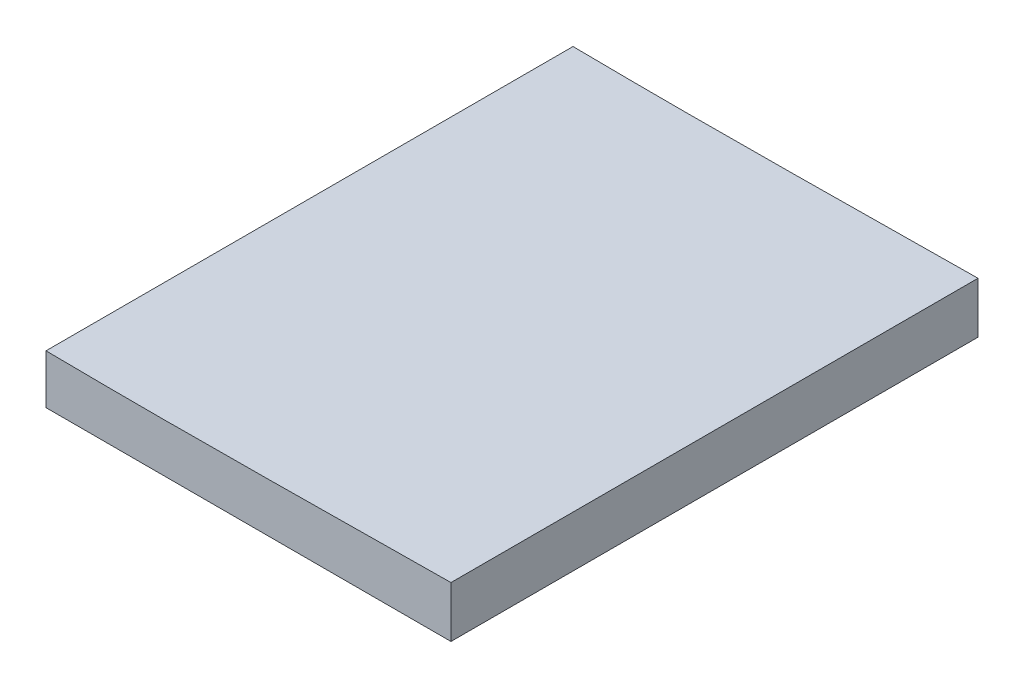
ISO-10303-21;
HEADER;
FILE_DESCRIPTION(('STEP AP214'),'2;1');
FILE_NAME('part.step','',(''),(''),'','','');
FILE_SCHEMA(('AUTOMOTIVE_DESIGN { 1 0 10303 214 1 1 1 1 }'));
ENDSEC;
DATA;
#1=APPLICATION_CONTEXT('core data for automotive mechanical design processes');
#2=APPLICATION_PROTOCOL_DEFINITION('international standard','automotive_design',2000,#1);
#3=PRODUCT_CONTEXT('',#1,'mechanical');
#4=PRODUCT('Part','Part','',(#3));
#5=PRODUCT_RELATED_PRODUCT_CATEGORY('part','',(#4));
#6=PRODUCT_DEFINITION_FORMATION('','',#4);
#7=PRODUCT_DEFINITION_CONTEXT('part definition',#1,'design');
#8=PRODUCT_DEFINITION('design','',#6,#7);
#9=PRODUCT_DEFINITION_SHAPE('','',#8);
#10=(LENGTH_UNIT() NAMED_UNIT(*) SI_UNIT(.MILLI.,.METRE.));
#11=(NAMED_UNIT(*) PLANE_ANGLE_UNIT() SI_UNIT($,.RADIAN.));
#12=(NAMED_UNIT(*) SI_UNIT($,.STERADIAN.) SOLID_ANGLE_UNIT());
#13=UNCERTAINTY_MEASURE_WITH_UNIT(LENGTH_MEASURE(1.E-05),#10,'distance_accuracy_value','');
#14=(GEOMETRIC_REPRESENTATION_CONTEXT(3) GLOBAL_UNCERTAINTY_ASSIGNED_CONTEXT((#13)) GLOBAL_UNIT_ASSIGNED_CONTEXT((#10,
#11,#12)) REPRESENTATION_CONTEXT('',''));
#15=CARTESIAN_POINT('',(0.,0.,0.));
#16=DIRECTION('',(0.,0.,1.));
#17=DIRECTION('',(1.,0.,0.));
#18=AXIS2_PLACEMENT_3D('',#15,#16,#17);
#19=CARTESIAN_POINT('',(122.012987748225,0.,0.));
#20=DIRECTION('',(1.,0.,0.));
#21=DIRECTION('',(0.,0.,-1.));
#22=AXIS2_PLACEMENT_3D('',#19,#20,#21);
#23=PLANE('',#22);
#24=DIRECTION('',(0.,0.,1.));
#25=VECTOR('',#24,1.);
#26=CARTESIAN_POINT('',(122.012987748225,-23.8936602432745,-577.230552036248));
#27=LINE('',#26,#25);
#28=CARTESIAN_POINT('',(122.012987748225,-23.8936602432745,75.0000000000001));
#29=VERTEX_POINT('',#28);
#30=CARTESIAN_POINT('',(122.012987748225,-23.8936602432745,205.14));
#31=VERTEX_POINT('',#30);
#32=EDGE_CURVE('E101',#29,#31,#27,.T.);
#33=ORIENTED_EDGE('',*,*,#32,.T.);
#34=DIRECTION('',(0.,1.,0.));
#35=VECTOR('',#34,1.);
#36=CARTESIAN_POINT('',(122.012987748225,0.,205.14));
#37=LINE('',#36,#35);
#38=CARTESIAN_POINT('',(122.012987738491,-11.7276413379153,205.14));
#39=VERTEX_POINT('',#38);
#40=EDGE_CURVE('E11',#31,#39,#37,.T.);
#41=ORIENTED_EDGE('',*,*,#40,.T.);
#42=DIRECTION('',(0.,0.,1.));
#43=VECTOR('',#42,1.);
#44=CARTESIAN_POINT('',(122.012987748225,-11.727641338036,205.14));
#45=LINE('',#44,#43);
#46=CARTESIAN_POINT('',(122.012987738491,-11.7276413379153,74.9999999999998));
#47=VERTEX_POINT('',#46);
#48=EDGE_CURVE('E51',#39,#47,#45,.F.);
#49=ORIENTED_EDGE('',*,*,#48,.T.);
#50=DIRECTION('',(0.,1.,0.));
#51=VECTOR('',#50,1.);
#52=CARTESIAN_POINT('',(122.012987748225,-23.8936852432745,75.));
#53=LINE('',#52,#51);
#54=EDGE_CURVE('E103',#29,#47,#53,.T.);
#55=ORIENTED_EDGE('',*,*,#54,.F.);
#56=EDGE_LOOP('',(#33,#41,#49,#55));
#57=FACE_BOUND('',#56,.T.);
#58=ADVANCED_FACE('F42',(#57),#23,.F.);
#59=CARTESIAN_POINT('',(0.,0.,205.14));
#60=DIRECTION('',(0.,0.,1.));
#61=DIRECTION('',(1.,0.,0.));
#62=AXIS2_PLACEMENT_3D('',#59,#60,#61);
#63=PLANE('',#62);
#64=DIRECTION('',(-1.,0.,0.));
#65=VECTOR('',#64,1.);
#66=CARTESIAN_POINT('',(148.930235791546,-23.8936602432745,205.14));
#67=LINE('',#66,#65);
#68=CARTESIAN_POINT('',(222.012987748225,-23.8936602432745,205.14));
#69=VERTEX_POINT('',#68);
#70=EDGE_CURVE('E45',#69,#31,#67,.T.);
#71=ORIENTED_EDGE('',*,*,#70,.F.);
#72=DIRECTION('',(0.,-1.,0.));
#73=VECTOR('',#72,1.);
#74=CARTESIAN_POINT('',(222.012987748225,-11.2872773614073,205.14));
#75=LINE('',#74,#73);
#76=CARTESIAN_POINT('',(222.012987748225,-11.2872773614073,205.14));
#77=VERTEX_POINT('',#76);
#78=EDGE_CURVE('E107',#77,#69,#75,.T.);
#79=ORIENTED_EDGE('',*,*,#78,.F.);
#80=CARTESIAN_POINT('',(222.012987748224,-11.2872773614074,205.14));
#81=CARTESIAN_POINT('',(218.919378665289,-11.3223973767478,205.14));
#82=CARTESIAN_POINT('',(205.647401932604,-11.467959012407,205.14));
#83=CARTESIAN_POINT('',(182.199512526804,-11.713706477298,205.14));
#84=CARTESIAN_POINT('',(151.674497926263,-11.9621131380845,205.14));
#85=CARTESIAN_POINT('',(121.162418160369,-11.7895754768441,205.14));
#86=CARTESIAN_POINT('',(95.7513309345537,-11.2827016840826,205.14));
#87=CARTESIAN_POINT('',(75.4345455748465,-10.6804028674471,205.14));
#88=CARTESIAN_POINT('',(60.2097930463776,-9.94096056040862,205.14));
#89=CARTESIAN_POINT('',(44.9946268760517,-8.80564765903787,205.14));
#90=CARTESIAN_POINT('',(32.3529914161165,-7.2837069255278,205.14));
#91=CARTESIAN_POINT('',(22.2477539606058,-5.63338955843548,205.14));
#92=CARTESIAN_POINT('',(14.6666085762918,-3.9200239548407,205.14));
#93=CARTESIAN_POINT('',(8.28802407863243,-1.74749382065163,205.14));
#94=CARTESIAN_POINT('',(2.90931259967548,0.956364700460667,205.14));
#95=CARTESIAN_POINT('',(-1.89672620175331,6.52309669841284,205.14));
#96=CARTESIAN_POINT('',(3.30662672053229,12.3039979945625,205.14));
#97=CARTESIAN_POINT('',(9.09601436595202,15.5028984571257,205.14));
#98=CARTESIAN_POINT('',(15.7472415942778,18.0443175722951,205.14));
#99=CARTESIAN_POINT('',(23.5496671131226,20.117144312983,205.14));
#100=CARTESIAN_POINT('',(33.8131815469566,22.3100945885303,205.14));
#101=CARTESIAN_POINT('',(46.6352298566183,24.0543554633795,205.14));
#102=CARTESIAN_POINT('',(61.9933352536892,25.2148612571156,205.14));
#103=CARTESIAN_POINT('',(77.2950113671835,25.6577224294329,205.14));
#104=CARTESIAN_POINT('',(97.6391657162876,25.4475340689814,205.14));
#105=CARTESIAN_POINT('',(123.024226631959,23.8278748307742,205.14));
#106=CARTESIAN_POINT('',(153.375544596371,20.4498563865987,205.14));
#107=CARTESIAN_POINT('',(183.689332827867,16.2123042667402,205.14));
#108=CARTESIAN_POINT('',(206.541071450016,12.2763423304222,205.14));
#109=CARTESIAN_POINT('',(219.305332632429,9.88286237214647,205.14));
#110=CARTESIAN_POINT('',(222.012987748224,9.36643436036431,205.14));
#111=B_SPLINE_CURVE_WITH_KNOTS('',3,(#80,#81,#82,#83,#84,#85,#86,#87,#88,#89,#90,#91,#92,#93,
#94,#95,#96,#97,#98,#99,#100,#101,#102,#103,#104,#105,#106,#107,#108,#109,#110),.UNSPECIFIED.,
.F.,.F.,(4,1,1,1,1,1,1,1,1,1,1,1,1,1,1,1,1,1,1,1,1,1,1,1,1,1,1,1,4),(0.135902519716628,
0.150834774390607,0.199963506565112,0.249080491590112,0.298166920869625,0.347226598260492,
0.371748790283378,0.39626612837323,0.42079170287225,0.445368985882971,0.457709830972341,
0.470165482504991,0.482949879419857,0.489791740716257,0.49994201682548,0.512136749797248,
0.519521461450315,0.532994464684655,0.545911051204923,0.558602295103549,0.583586074296184,
0.608309666465215,0.632909244550233,0.657448148326611,0.706484295518651,0.755595699663312,
0.804819773504179,0.854194550210178,0.867498350403516),.UNSPECIFIED.);
#112=EDGE_CURVE('E187',#39,#77,#111,.F.);
#113=ORIENTED_EDGE('',*,*,#112,.F.);
#114=ORIENTED_EDGE('',*,*,#40,.F.);
#115=EDGE_LOOP('',(#71,#79,#113,#114));
#116=FACE_BOUND('',#115,.T.);
#117=ADVANCED_FACE('F130',(#116),#63,.T.);
#118=CARTESIAN_POINT('',(222.012987748225,-11.2872773614073,-577.230552036248));
#119=DIRECTION('',(1.,0.,0.));
#120=DIRECTION('',(0.,0.,-1.));
#121=AXIS2_PLACEMENT_3D('',#118,#119,#120);
#122=PLANE('',#121);
#123=DIRECTION('',(0.,0.,1.));
#124=VECTOR('',#123,1.);
#125=CARTESIAN_POINT('',(222.012987748225,-11.2872773614073,-577.230552036248));
#126=LINE('',#125,#124);
#127=CARTESIAN_POINT('',(222.012987748224,-11.2872773614074,74.9999999999998));
#128=VERTEX_POINT('',#127);
#129=EDGE_CURVE('E109',#128,#77,#126,.T.);
#130=ORIENTED_EDGE('',*,*,#129,.T.);
#131=ORIENTED_EDGE('',*,*,#78,.T.);
#132=DIRECTION('',(0.,0.,1.));
#133=VECTOR('',#132,1.);
#134=CARTESIAN_POINT('',(222.012987748225,-23.8936602432745,-577.230552036248));
#135=LINE('',#134,#133);
#136=CARTESIAN_POINT('',(222.012987748225,-23.8936602432745,75.0000000000001));
#137=VERTEX_POINT('',#136);
#138=EDGE_CURVE('E100',#137,#69,#135,.T.);
#139=ORIENTED_EDGE('',*,*,#138,.F.);
#140=DIRECTION('',(0.,-1.,0.));
#141=VECTOR('',#140,1.);
#142=CARTESIAN_POINT('',(222.012987748225,-11.2872773614073,75.0000000000001));
#143=LINE('',#142,#141);
#144=EDGE_CURVE('E84',#128,#137,#143,.T.);
#145=ORIENTED_EDGE('',*,*,#144,.F.);
#146=EDGE_LOOP('',(#130,#131,#139,#145));
#147=FACE_BOUND('',#146,.T.);
#148=ADVANCED_FACE('F105',(#147),#122,.T.);
#149=CARTESIAN_POINT('',(222.012987748224,-11.2872773614074,-577.230552036248));
#150=CARTESIAN_POINT('',(218.919378665289,-11.3223973767478,-577.230552036248));
#151=CARTESIAN_POINT('',(205.647401932604,-11.467959012407,-577.230552036248));
#152=CARTESIAN_POINT('',(182.199512526804,-11.713706477298,-577.230552036248));
#153=CARTESIAN_POINT('',(151.674497926263,-11.9621131380845,-577.230552036248));
#154=CARTESIAN_POINT('',(121.162418160369,-11.7895754768441,-577.230552036248));
#155=CARTESIAN_POINT('',(95.7513309345537,-11.2827016840826,-577.230552036248));
#156=CARTESIAN_POINT('',(75.4345455748465,-10.6804028674471,-577.230552036248));
#157=CARTESIAN_POINT('',(60.2097930463776,-9.94096056040862,-577.230552036248));
#158=CARTESIAN_POINT('',(44.9946268760517,-8.80564765903787,-577.230552036248));
#159=CARTESIAN_POINT('',(32.3529914161165,-7.2837069255278,-577.230552036248));
#160=CARTESIAN_POINT('',(22.2477539606058,-5.63338955843548,-577.230552036248));
#161=CARTESIAN_POINT('',(14.6666085762918,-3.9200239548407,-577.230552036248));
#162=CARTESIAN_POINT('',(8.28802407863243,-1.74749382065163,-577.230552036248));
#163=CARTESIAN_POINT('',(2.90931259967548,0.956364700460667,-577.230552036248));
#164=CARTESIAN_POINT('',(-1.89672620175331,6.52309669841284,-577.230552036248));
#165=CARTESIAN_POINT('',(3.30662672053229,12.3039979945625,-577.230552036248));
#166=CARTESIAN_POINT('',(9.09601436595202,15.5028984571257,-577.230552036248));
#167=CARTESIAN_POINT('',(15.7472415942778,18.0443175722951,-577.230552036248));
#168=CARTESIAN_POINT('',(23.5496671131226,20.117144312983,-577.230552036248));
#169=CARTESIAN_POINT('',(33.8131815469566,22.3100945885303,-577.230552036248));
#170=CARTESIAN_POINT('',(46.6352298566183,24.0543554633795,-577.230552036248));
#171=CARTESIAN_POINT('',(61.9933352536892,25.2148612571156,-577.230552036248));
#172=CARTESIAN_POINT('',(77.2950113671835,25.6577224294329,-577.230552036248));
#173=CARTESIAN_POINT('',(97.6391657162876,25.4475340689814,-577.230552036248));
#174=CARTESIAN_POINT('',(123.024226631959,23.8278748307742,-577.230552036248));
#175=CARTESIAN_POINT('',(153.375544596371,20.4498563865987,-577.230552036248));
#176=CARTESIAN_POINT('',(183.689332827867,16.2123042667402,-577.230552036248));
#177=CARTESIAN_POINT('',(206.541071450016,12.2763423304222,-577.230552036248));
#178=CARTESIAN_POINT('',(219.305332632429,9.88286237214647,-577.230552036248));
#179=CARTESIAN_POINT('',(222.012987748224,9.36643436036431,-577.230552036248));
#180=B_SPLINE_CURVE_WITH_KNOTS('',3,(#149,#150,#151,#152,#153,#154,#155,#156,#157,#158,#159,
#160,#161,#162,#163,#164,#165,#166,#167,#168,#169,#170,#171,#172,#173,#174,#175,#176,#177,#178,
#179),.UNSPECIFIED.,.F.,.F.,(4,1,1,1,1,1,1,1,1,1,1,1,1,1,1,1,1,1,1,1,1,1,1,1,1,1,1,1,4),
(0.135902519716628,0.150834774390607,0.199963506565112,0.249080491590112,0.298166920869625,
0.347226598260492,0.371748790283378,0.39626612837323,0.42079170287225,0.445368985882971,
0.457709830972341,0.470165482504991,0.482949879419857,0.489791740716257,0.49994201682548,
0.512136749797248,0.519521461450315,0.532994464684655,0.545911051204923,0.558602295103549,
0.583586074296184,0.608309666465215,0.632909244550233,0.657448148326611,0.706484295518651,
0.755595699663312,0.804819773504179,0.854194550210178,0.867498350403516),.UNSPECIFIED.);
#181=DIRECTION('',(0.,0.,1.));
#182=VECTOR('',#181,1.);
#183=SURFACE_OF_LINEAR_EXTRUSION('',#180,#182);
#184=ORIENTED_EDGE('',*,*,#48,.F.);
#185=ORIENTED_EDGE('',*,*,#112,.T.);
#186=ORIENTED_EDGE('',*,*,#129,.F.);
#187=CARTESIAN_POINT('',(222.012987748224,-11.2872773614074,74.9999999999998));
#188=CARTESIAN_POINT('',(218.919378665289,-11.3223973767478,74.9999999999998));
#189=CARTESIAN_POINT('',(205.647401932604,-11.467959012407,74.9999999999998));
#190=CARTESIAN_POINT('',(182.199512526804,-11.713706477298,74.9999999999998));
#191=CARTESIAN_POINT('',(151.674497926263,-11.9621131380845,74.9999999999998));
#192=CARTESIAN_POINT('',(121.162418160369,-11.7895754768441,74.9999999999998));
#193=CARTESIAN_POINT('',(95.7513309345537,-11.2827016840826,74.9999999999998));
#194=CARTESIAN_POINT('',(75.4345455748465,-10.6804028674471,74.9999999999998));
#195=CARTESIAN_POINT('',(60.2097930463776,-9.94096056040862,74.9999999999998));
#196=CARTESIAN_POINT('',(44.9946268760517,-8.80564765903787,74.9999999999998));
#197=CARTESIAN_POINT('',(32.3529914161165,-7.2837069255278,74.9999999999998));
#198=CARTESIAN_POINT('',(22.2477539606058,-5.63338955843548,74.9999999999998));
#199=CARTESIAN_POINT('',(14.6666085762918,-3.9200239548407,74.9999999999998));
#200=CARTESIAN_POINT('',(8.28802407863243,-1.74749382065163,74.9999999999998));
#201=CARTESIAN_POINT('',(2.90931259967548,0.956364700460667,74.9999999999998));
#202=CARTESIAN_POINT('',(-1.89672620175331,6.52309669841284,74.9999999999998));
#203=CARTESIAN_POINT('',(3.30662672053229,12.3039979945625,74.9999999999998));
#204=CARTESIAN_POINT('',(9.09601436595202,15.5028984571257,74.9999999999998));
#205=CARTESIAN_POINT('',(15.7472415942778,18.0443175722951,74.9999999999998));
#206=CARTESIAN_POINT('',(23.5496671131226,20.117144312983,74.9999999999998));
#207=CARTESIAN_POINT('',(33.8131815469566,22.3100945885303,74.9999999999998));
#208=CARTESIAN_POINT('',(46.6352298566183,24.0543554633795,74.9999999999998));
#209=CARTESIAN_POINT('',(61.9933352536892,25.2148612571156,74.9999999999998));
#210=CARTESIAN_POINT('',(77.2950113671835,25.6577224294329,74.9999999999998));
#211=CARTESIAN_POINT('',(97.6391657162876,25.4475340689814,74.9999999999998));
#212=CARTESIAN_POINT('',(123.024226631959,23.8278748307742,74.9999999999998));
#213=CARTESIAN_POINT('',(153.375544596371,20.4498563865987,74.9999999999998));
#214=CARTESIAN_POINT('',(183.689332827867,16.2123042667402,74.9999999999998));
#215=CARTESIAN_POINT('',(206.541071450016,12.2763423304222,74.9999999999998));
#216=CARTESIAN_POINT('',(219.305332632429,9.88286237214647,74.9999999999998));
#217=CARTESIAN_POINT('',(222.012987748224,9.36643436036431,74.9999999999998));
#218=B_SPLINE_CURVE_WITH_KNOTS('',3,(#187,#188,#189,#190,#191,#192,#193,#194,#195,#196,#197,
#198,#199,#200,#201,#202,#203,#204,#205,#206,#207,#208,#209,#210,#211,#212,#213,#214,#215,#216,
#217),.UNSPECIFIED.,.F.,.F.,(4,1,1,1,1,1,1,1,1,1,1,1,1,1,1,1,1,1,1,1,1,1,1,1,1,1,1,1,4),
(0.135902519716628,0.150834774390607,0.199963506565112,0.249080491590112,0.298166920869625,
0.347226598260492,0.371748790283378,0.39626612837323,0.42079170287225,0.445368985882971,
0.457709830972341,0.470165482504991,0.482949879419857,0.489791740716257,0.49994201682548,
0.512136749797248,0.519521461450315,0.532994464684655,0.545911051204923,0.558602295103549,
0.583586074296184,0.608309666465215,0.632909244550233,0.657448148326611,0.706484295518651,
0.755595699663312,0.804819773504179,0.854194550210178,0.867498350403516),.UNSPECIFIED.);
#219=EDGE_CURVE('E88',#47,#128,#218,.F.);
#220=ORIENTED_EDGE('',*,*,#219,.F.);
#221=EDGE_LOOP('',(#184,#185,#186,#220));
#222=FACE_BOUND('',#221,.T.);
#223=ADVANCED_FACE('F124',(#222),#183,.T.);
#224=CARTESIAN_POINT('',(148.930235791546,-23.8936602432745,-577.230552036248));
#225=DIRECTION('',(0.,-1.,0.));
#226=DIRECTION('',(0.,0.,-1.));
#227=AXIS2_PLACEMENT_3D('',#224,#225,#226);
#228=PLANE('',#227);
#229=ORIENTED_EDGE('',*,*,#138,.T.);
#230=ORIENTED_EDGE('',*,*,#70,.T.);
#231=ORIENTED_EDGE('',*,*,#32,.F.);
#232=DIRECTION('',(-1.,0.,0.));
#233=VECTOR('',#232,1.);
#234=CARTESIAN_POINT('',(148.930235791546,-23.8936602432745,75.0000000000001));
#235=LINE('',#234,#233);
#236=EDGE_CURVE('E87',#137,#29,#235,.T.);
#237=ORIENTED_EDGE('',*,*,#236,.F.);
#238=EDGE_LOOP('',(#229,#230,#231,#237));
#239=FACE_BOUND('',#238,.T.);
#240=ADVANCED_FACE('F98',(#239),#228,.T.);
#241=CARTESIAN_POINT('',(-38.9931160740325,-23.8936852432745,75.));
#242=DIRECTION('',(0.,0.,1.));
#243=DIRECTION('',(1.,0.,0.));
#244=AXIS2_PLACEMENT_3D('',#241,#242,#243);
#245=PLANE('',#244);
#246=ORIENTED_EDGE('',*,*,#236,.T.);
#247=ORIENTED_EDGE('',*,*,#54,.T.);
#248=ORIENTED_EDGE('',*,*,#219,.T.);
#249=ORIENTED_EDGE('',*,*,#144,.T.);
#250=EDGE_LOOP('',(#246,#247,#248,#249));
#251=FACE_BOUND('',#250,.T.);
#252=ADVANCED_FACE('F86',(#251),#245,.F.);
#253=CLOSED_SHELL('',(#58,#117,#148,#223,#240,#252));
#254=MANIFOLD_SOLID_BREP('B2',#253);
#255=ADVANCED_BREP_SHAPE_REPRESENTATION('',(#18,#254),#14);
#256=SHAPE_DEFINITION_REPRESENTATION(#9,#255);
ENDSEC;
END-ISO-10303-21;
